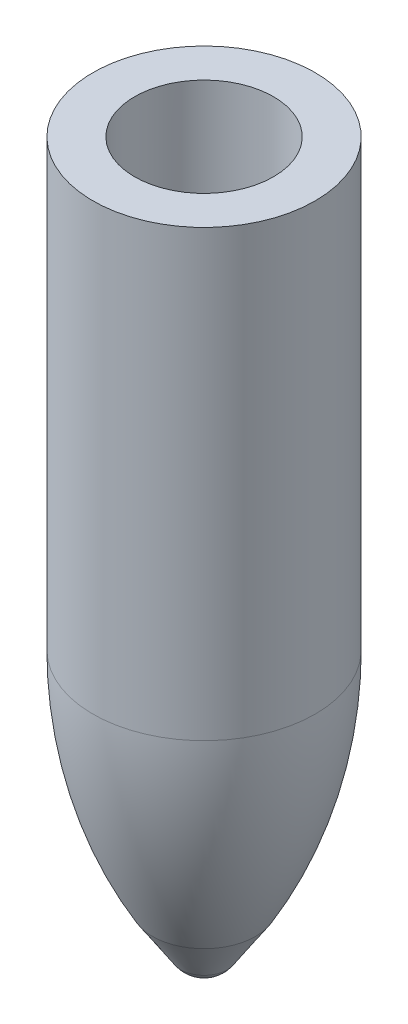
ISO-10303-21;
HEADER;
FILE_DESCRIPTION(('STEP AP214'),'2;1');
FILE_NAME('part.step','',(''),(''),'','','');
FILE_SCHEMA(('AUTOMOTIVE_DESIGN { 1 0 10303 214 1 1 1 1 }'));
ENDSEC;
DATA;
#1=APPLICATION_CONTEXT('core data for automotive mechanical design processes');
#2=APPLICATION_PROTOCOL_DEFINITION('international standard','automotive_design',2000,#1);
#3=PRODUCT_CONTEXT('',#1,'mechanical');
#4=PRODUCT('Part','Part','',(#3));
#5=PRODUCT_RELATED_PRODUCT_CATEGORY('part','',(#4));
#6=PRODUCT_DEFINITION_FORMATION('','',#4);
#7=PRODUCT_DEFINITION_CONTEXT('part definition',#1,'design');
#8=PRODUCT_DEFINITION('design','',#6,#7);
#9=PRODUCT_DEFINITION_SHAPE('','',#8);
#10=(LENGTH_UNIT() NAMED_UNIT(*) SI_UNIT(.MILLI.,.METRE.));
#11=(NAMED_UNIT(*) PLANE_ANGLE_UNIT() SI_UNIT($,.RADIAN.));
#12=(NAMED_UNIT(*) SI_UNIT($,.STERADIAN.) SOLID_ANGLE_UNIT());
#13=UNCERTAINTY_MEASURE_WITH_UNIT(LENGTH_MEASURE(1.E-05),#10,'distance_accuracy_value','');
#14=(GEOMETRIC_REPRESENTATION_CONTEXT(3) GLOBAL_UNCERTAINTY_ASSIGNED_CONTEXT((#13)) GLOBAL_UNIT_ASSIGNED_CONTEXT((#10,
#11,#12)) REPRESENTATION_CONTEXT('',''));
#15=CARTESIAN_POINT('',(0.,0.,0.));
#16=DIRECTION('',(0.,0.,1.));
#17=DIRECTION('',(1.,0.,0.));
#18=AXIS2_PLACEMENT_3D('',#15,#16,#17);
#19=CARTESIAN_POINT('',(12.7,0.,0.));
#20=DIRECTION('',(0.,-1.,0.));
#21=DIRECTION('',(1.,0.,0.));
#22=AXIS2_PLACEMENT_3D('',#19,#20,#21);
#23=PLANE('',#22);
#24=CARTESIAN_POINT('',(12.7,0.,0.));
#25=DIRECTION('',(0.,-1.,0.));
#26=DIRECTION('',(1.,0.,0.));
#27=AXIS2_PLACEMENT_3D('',#24,#25,#26);
#28=CIRCLE('',#27,7.9375);
#29=CARTESIAN_POINT('',(20.6375,0.,0.));
#30=VERTEX_POINT('',#29);
#31=EDGE_CURVE('E49',#30,#30,#28,.T.);
#32=ORIENTED_EDGE('',*,*,#31,.T.);
#33=EDGE_LOOP('',(#32));
#34=FACE_BOUND('',#33,.T.);
#35=CARTESIAN_POINT('',(12.7,0.,0.));
#36=DIRECTION('',(0.,-1.,0.));
#37=DIRECTION('',(1.,0.,0.));
#38=AXIS2_PLACEMENT_3D('',#35,#36,#37);
#39=CIRCLE('',#38,12.7);
#40=CARTESIAN_POINT('',(25.4,0.,0.));
#41=VERTEX_POINT('',#40);
#42=EDGE_CURVE('E10',#41,#41,#39,.T.);
#43=ORIENTED_EDGE('',*,*,#42,.F.);
#44=EDGE_LOOP('',(#43));
#45=FACE_BOUND('',#44,.T.);
#46=ADVANCED_FACE('F37',(#34,#45),#23,.F.);
#47=CARTESIAN_POINT('',(12.7,-84.4010416505203,0.));
#48=DIRECTION('',(0.,-1.,0.));
#49=DIRECTION('',(1.,0.,0.));
#50=AXIS2_PLACEMENT_3D('',#47,#48,#49);
#51=CYLINDRICAL_SURFACE('',#50,12.7);
#52=CARTESIAN_POINT('',(12.7,-50.8,0.));
#53=DIRECTION('',(0.,-1.,0.));
#54=DIRECTION('',(1.,0.,0.));
#55=AXIS2_PLACEMENT_3D('',#52,#53,#54);
#56=CIRCLE('',#55,12.7);
#57=CARTESIAN_POINT('',(25.4,-50.8,0.));
#58=VERTEX_POINT('',#57);
#59=EDGE_CURVE('E44',#58,#58,#56,.T.);
#60=ORIENTED_EDGE('',*,*,#59,.F.);
#61=EDGE_LOOP('',(#60));
#62=FACE_BOUND('',#61,.T.);
#63=ORIENTED_EDGE('',*,*,#42,.T.);
#64=EDGE_LOOP('',(#63));
#65=FACE_BOUND('',#64,.T.);
#66=ADVANCED_FACE('F82',(#62,#65),#51,.T.);
#67=CARTESIAN_POINT('',(12.7,-84.4010416505203,0.));
#68=DIRECTION('',(0.,-1.,0.));
#69=DIRECTION('',(1.,0.,0.));
#70=AXIS2_PLACEMENT_3D('',#67,#68,#69);
#71=CYLINDRICAL_SURFACE('',#70,7.9375);
#72=CARTESIAN_POINT('',(12.7,-50.8,0.));
#73=DIRECTION('',(0.,1.,0.));
#74=DIRECTION('',(0.,0.,1.));
#75=AXIS2_PLACEMENT_3D('',#72,#73,#74);
#76=CIRCLE('',#75,7.93750000000001);
#77=CARTESIAN_POINT('',(12.7,-50.8,7.93750000000001));
#78=VERTEX_POINT('',#77);
#79=EDGE_CURVE('E54',#78,#78,#76,.T.);
#80=ORIENTED_EDGE('',*,*,#79,.F.);
#81=EDGE_LOOP('',(#80));
#82=FACE_BOUND('',#81,.T.);
#83=ORIENTED_EDGE('',*,*,#31,.F.);
#84=EDGE_LOOP('',(#83));
#85=FACE_BOUND('',#84,.T.);
#86=ADVANCED_FACE('F87',(#82,#85),#71,.F.);
#87=CARTESIAN_POINT('',(0.,-50.8,0.));
#88=DIRECTION('',(0.,-1.,0.));
#89=DIRECTION('',(1.,0.,0.));
#90=AXIS2_PLACEMENT_3D('',#87,#88,#89);
#91=PLANE('',#90);
#92=ORIENTED_EDGE('',*,*,#79,.T.);
#93=EDGE_LOOP('',(#92));
#94=FACE_BOUND('',#93,.T.);
#95=ADVANCED_FACE('F93',(#94),#91,.F.);
#96=CARTESIAN_POINT('',(12.7,-79.3845211154623,0.));
#97=DIRECTION('',(0.,-1.,0.));
#98=DIRECTION('',(-1.,0.,0.));
#99=AXIS2_PLACEMENT_3D('',#96,#97,#98);
#100=SPHERICAL_SURFACE('',#99,3.17500000000001);
#101=CARTESIAN_POINT('',(12.7,-81.128995308738,0.));
#102=DIRECTION('',(0.,-1.,0.));
#103=DIRECTION('',(1.,0.,0.));
#104=AXIS2_PLACEMENT_3D('',#101,#102,#103);
#105=CIRCLE('',#104,2.65281638810435);
#106=CARTESIAN_POINT('',(15.3528163881044,-81.128995308738,0.));
#107=VERTEX_POINT('',#106);
#108=EDGE_CURVE('E64',#107,#107,#105,.T.);
#109=ORIENTED_EDGE('',*,*,#108,.T.);
#110=EDGE_LOOP('',(#109));
#111=FACE_BOUND('',#110,.T.);
#112=ADVANCED_FACE('F69',(#111),#100,.T.);
#113=CARTESIAN_POINT('',(12.7,-50.8,0.));
#114=DIRECTION('',(0.,-1.,0.));
#115=DIRECTION('',(1.,0.,0.));
#116=AXIS2_PLACEMENT_3D('',#113,#114,#115);
#117=DEGENERATE_TOROIDAL_SURFACE('',#116,38.1,50.8,.F.);
#118=CARTESIAN_POINT('',(12.7,-76.2,0.));
#119=DIRECTION('',(0.,-1.,0.));
#120=DIRECTION('',(1.,0.,0.));
#121=AXIS2_PLACEMENT_3D('',#118,#119,#120);
#122=CIRCLE('',#121,5.89409051224951);
#123=CARTESIAN_POINT('',(18.5940905122495,-76.2,0.));
#124=VERTEX_POINT('',#123);
#125=EDGE_CURVE('E60',#124,#124,#122,.T.);
#126=ORIENTED_EDGE('',*,*,#125,.F.);
#127=EDGE_LOOP('',(#126));
#128=FACE_BOUND('',#127,.T.);
#129=ORIENTED_EDGE('',*,*,#59,.T.);
#130=EDGE_LOOP('',(#129));
#131=FACE_BOUND('',#130,.T.);
#132=ADVANCED_FACE('F73',(#128,#131),#117,.F.);
#133=CARTESIAN_POINT('',(12.7,-81.128995308738,0.));
#134=DIRECTION('',(0.,1.,0.));
#135=DIRECTION('',(-1.,0.,0.));
#136=AXIS2_PLACEMENT_3D('',#133,#134,#135);
#137=CONICAL_SURFACE('',#136,2.65281638810435,0.581694686109182);
#138=ORIENTED_EDGE('',*,*,#125,.T.);
#139=EDGE_LOOP('',(#138));
#140=FACE_BOUND('',#139,.T.);
#141=ORIENTED_EDGE('',*,*,#108,.F.);
#142=EDGE_LOOP('',(#141));
#143=FACE_BOUND('',#142,.T.);
#144=ADVANCED_FACE('F71',(#140,#143),#137,.T.);
#145=CLOSED_SHELL('',(#46,#66,#86,#95,#112,#132,#144));
#146=MANIFOLD_SOLID_BREP('B2',#145);
#147=ADVANCED_BREP_SHAPE_REPRESENTATION('',(#18,#146),#14);
#148=SHAPE_DEFINITION_REPRESENTATION(#9,#147);
ENDSEC;
END-ISO-10303-21;
